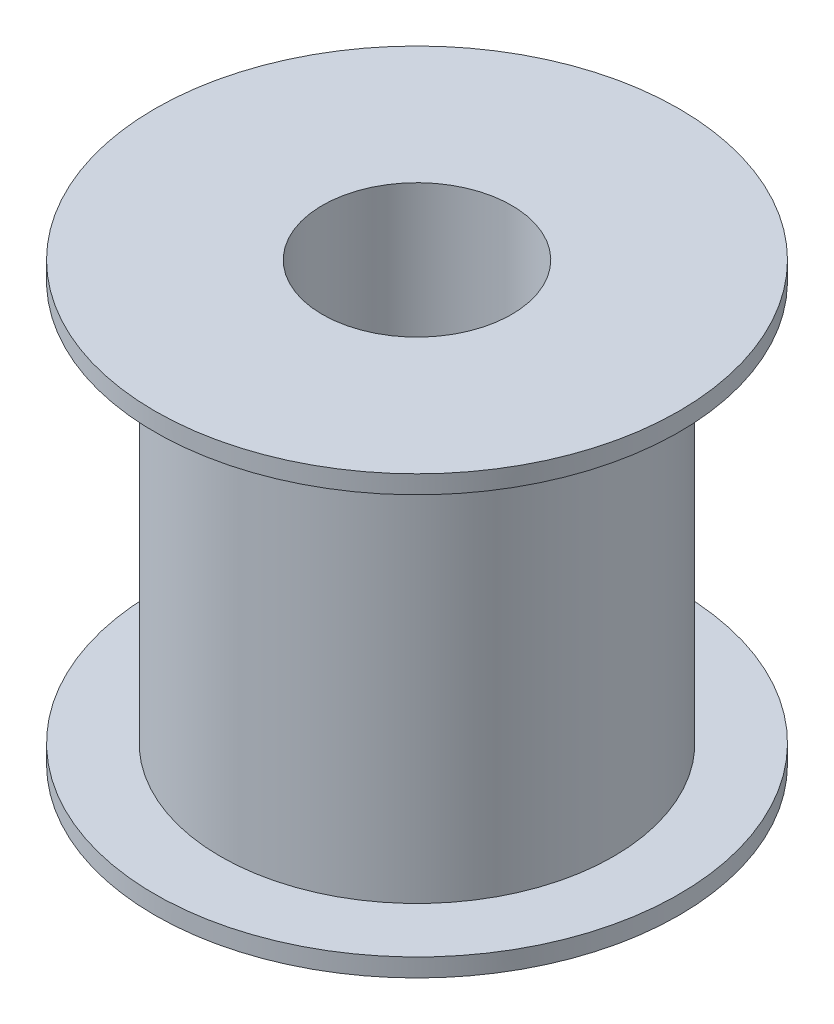
ISO-10303-21;
HEADER;
FILE_DESCRIPTION(('STEP AP214'),'2;1');
FILE_NAME('part.step','',(''),(''),'','','');
FILE_SCHEMA(('AUTOMOTIVE_DESIGN { 1 0 10303 214 1 1 1 1 }'));
ENDSEC;
DATA;
#1=APPLICATION_CONTEXT('core data for automotive mechanical design processes');
#2=APPLICATION_PROTOCOL_DEFINITION('international standard','automotive_design',2000,#1);
#3=PRODUCT_CONTEXT('',#1,'mechanical');
#4=PRODUCT('Part','Part','',(#3));
#5=PRODUCT_RELATED_PRODUCT_CATEGORY('part','',(#4));
#6=PRODUCT_DEFINITION_FORMATION('','',#4);
#7=PRODUCT_DEFINITION_CONTEXT('part definition',#1,'design');
#8=PRODUCT_DEFINITION('design','',#6,#7);
#9=PRODUCT_DEFINITION_SHAPE('','',#8);
#10=(LENGTH_UNIT() NAMED_UNIT(*) SI_UNIT(.MILLI.,.METRE.));
#11=(NAMED_UNIT(*) PLANE_ANGLE_UNIT() SI_UNIT($,.RADIAN.));
#12=(NAMED_UNIT(*) SI_UNIT($,.STERADIAN.) SOLID_ANGLE_UNIT());
#13=UNCERTAINTY_MEASURE_WITH_UNIT(LENGTH_MEASURE(1.E-05),#10,'distance_accuracy_value','');
#14=(GEOMETRIC_REPRESENTATION_CONTEXT(3) GLOBAL_UNCERTAINTY_ASSIGNED_CONTEXT((#13)) GLOBAL_UNIT_ASSIGNED_CONTEXT((#10,
#11,#12)) REPRESENTATION_CONTEXT('',''));
#15=CARTESIAN_POINT('',(0.,0.,0.));
#16=DIRECTION('',(0.,0.,1.));
#17=DIRECTION('',(1.,0.,0.));
#18=AXIS2_PLACEMENT_3D('',#15,#16,#17);
#19=CARTESIAN_POINT('',(0.,60.,0.));
#20=DIRECTION('',(0.,-1.,0.));
#21=DIRECTION('',(0.,0.,-1.));
#22=AXIS2_PLACEMENT_3D('',#19,#20,#21);
#23=CYLINDRICAL_SURFACE('',#22,36.);
#24=CARTESIAN_POINT('',(0.,0.,0.));
#25=DIRECTION('',(0.,1.,0.));
#26=DIRECTION('',(0.,0.,1.));
#27=AXIS2_PLACEMENT_3D('',#24,#25,#26);
#28=CIRCLE('',#27,36.);
#29=CARTESIAN_POINT('',(0.,0.,36.));
#30=VERTEX_POINT('',#29);
#31=EDGE_CURVE('E43',#30,#30,#28,.T.);
#32=ORIENTED_EDGE('',*,*,#31,.T.);
#33=EDGE_LOOP('',(#32));
#34=FACE_BOUND('',#33,.T.);
#35=CARTESIAN_POINT('',(0.,2.5,0.));
#36=DIRECTION('',(0.,-1.,0.));
#37=DIRECTION('',(0.,0.,-1.));
#38=AXIS2_PLACEMENT_3D('',#35,#36,#37);
#39=CIRCLE('',#38,36.);
#40=CARTESIAN_POINT('',(0.,2.5,-36.));
#41=VERTEX_POINT('',#40);
#42=EDGE_CURVE('E55',#41,#41,#39,.T.);
#43=ORIENTED_EDGE('',*,*,#42,.T.);
#44=EDGE_LOOP('',(#43));
#45=FACE_BOUND('',#44,.T.);
#46=ADVANCED_FACE('F40',(#34,#45),#23,.T.);
#47=CARTESIAN_POINT('',(0.,60.,0.));
#48=DIRECTION('',(0.,1.,0.));
#49=DIRECTION('',(0.,0.,1.));
#50=AXIS2_PLACEMENT_3D('',#47,#48,#49);
#51=CIRCLE('',#50,36.);
#52=CARTESIAN_POINT('',(0.,60.,36.));
#53=VERTEX_POINT('',#52);
#54=EDGE_CURVE('E10',#53,#53,#51,.T.);
#55=ORIENTED_EDGE('',*,*,#54,.F.);
#56=EDGE_LOOP('',(#55));
#57=FACE_BOUND('',#56,.T.);
#58=CARTESIAN_POINT('',(0.,57.5,0.));
#59=DIRECTION('',(0.,-1.,0.));
#60=DIRECTION('',(0.,0.,-1.));
#61=AXIS2_PLACEMENT_3D('',#58,#59,#60);
#62=CIRCLE('',#61,36.);
#63=CARTESIAN_POINT('',(0.,57.5,-36.));
#64=VERTEX_POINT('',#63);
#65=EDGE_CURVE('E66',#64,#64,#62,.T.);
#66=ORIENTED_EDGE('',*,*,#65,.F.);
#67=EDGE_LOOP('',(#66));
#68=FACE_BOUND('',#67,.T.);
#69=ADVANCED_FACE('F73',(#57,#68),#23,.T.);
#70=CARTESIAN_POINT('',(0.,60.,0.));
#71=DIRECTION('',(0.,1.,0.));
#72=DIRECTION('',(0.,0.,1.));
#73=AXIS2_PLACEMENT_3D('',#70,#71,#72);
#74=PLANE('',#73);
#75=ORIENTED_EDGE('',*,*,#54,.T.);
#76=EDGE_LOOP('',(#75));
#77=FACE_BOUND('',#76,.T.);
#78=CARTESIAN_POINT('',(0.,60.,0.));
#79=DIRECTION('',(0.,1.,0.));
#80=DIRECTION('',(0.,0.,1.));
#81=AXIS2_PLACEMENT_3D('',#78,#79,#80);
#82=CIRCLE('',#81,13.);
#83=CARTESIAN_POINT('',(0.,60.,13.));
#84=VERTEX_POINT('',#83);
#85=EDGE_CURVE('E50',#84,#84,#82,.T.);
#86=ORIENTED_EDGE('',*,*,#85,.F.);
#87=EDGE_LOOP('',(#86));
#88=FACE_BOUND('',#87,.T.);
#89=ADVANCED_FACE('F75',(#77,#88),#74,.T.);
#90=CARTESIAN_POINT('',(0.,0.,0.));
#91=DIRECTION('',(0.,1.,0.));
#92=DIRECTION('',(0.,0.,1.));
#93=AXIS2_PLACEMENT_3D('',#90,#91,#92);
#94=PLANE('',#93);
#95=ORIENTED_EDGE('',*,*,#31,.F.);
#96=EDGE_LOOP('',(#95));
#97=FACE_BOUND('',#96,.T.);
#98=CARTESIAN_POINT('',(0.,0.,0.));
#99=DIRECTION('',(0.,1.,0.));
#100=DIRECTION('',(0.,0.,1.));
#101=AXIS2_PLACEMENT_3D('',#98,#99,#100);
#102=CIRCLE('',#101,13.);
#103=CARTESIAN_POINT('',(0.,0.,13.));
#104=VERTEX_POINT('',#103);
#105=EDGE_CURVE('E52',#104,#104,#102,.T.);
#106=ORIENTED_EDGE('',*,*,#105,.T.);
#107=EDGE_LOOP('',(#106));
#108=FACE_BOUND('',#107,.T.);
#109=ADVANCED_FACE('F81',(#97,#108),#94,.F.);
#110=CARTESIAN_POINT('',(0.,60.,0.));
#111=DIRECTION('',(0.,-1.,0.));
#112=DIRECTION('',(0.,0.,-1.));
#113=AXIS2_PLACEMENT_3D('',#110,#111,#112);
#114=CYLINDRICAL_SURFACE('',#113,13.);
#115=ORIENTED_EDGE('',*,*,#85,.T.);
#116=EDGE_LOOP('',(#115));
#117=FACE_BOUND('',#116,.T.);
#118=ORIENTED_EDGE('',*,*,#105,.F.);
#119=EDGE_LOOP('',(#118));
#120=FACE_BOUND('',#119,.T.);
#121=ADVANCED_FACE('F93',(#117,#120),#114,.F.);
#122=CARTESIAN_POINT('',(-36.,2.5,0.));
#123=DIRECTION('',(0.,1.,0.));
#124=DIRECTION('',(0.,0.,1.));
#125=AXIS2_PLACEMENT_3D('',#122,#123,#124);
#126=PLANE('',#125);
#127=CARTESIAN_POINT('',(0.,2.5,0.));
#128=DIRECTION('',(0.,-1.,0.));
#129=DIRECTION('',(0.,0.,-1.));
#130=AXIS2_PLACEMENT_3D('',#127,#128,#129);
#131=CIRCLE('',#130,27.);
#132=CARTESIAN_POINT('',(0.,2.5,-27.));
#133=VERTEX_POINT('',#132);
#134=EDGE_CURVE('E60',#133,#133,#131,.T.);
#135=ORIENTED_EDGE('',*,*,#134,.T.);
#136=EDGE_LOOP('',(#135));
#137=FACE_BOUND('',#136,.T.);
#138=ORIENTED_EDGE('',*,*,#42,.F.);
#139=EDGE_LOOP('',(#138));
#140=FACE_BOUND('',#139,.T.);
#141=ADVANCED_FACE('F90',(#137,#140),#126,.T.);
#142=CARTESIAN_POINT('',(0.,0.,0.));
#143=DIRECTION('',(0.,-1.,0.));
#144=DIRECTION('',(0.,0.,-1.));
#145=AXIS2_PLACEMENT_3D('',#142,#143,#144);
#146=CYLINDRICAL_SURFACE('',#145,27.);
#147=CARTESIAN_POINT('',(0.,57.5,0.));
#148=DIRECTION('',(0.,-1.,0.));
#149=DIRECTION('',(0.,0.,-1.));
#150=AXIS2_PLACEMENT_3D('',#147,#148,#149);
#151=CIRCLE('',#150,27.);
#152=CARTESIAN_POINT('',(0.,57.5,-27.));
#153=VERTEX_POINT('',#152);
#154=EDGE_CURVE('E63',#153,#153,#151,.T.);
#155=ORIENTED_EDGE('',*,*,#154,.T.);
#156=EDGE_LOOP('',(#155));
#157=FACE_BOUND('',#156,.T.);
#158=ORIENTED_EDGE('',*,*,#134,.F.);
#159=EDGE_LOOP('',(#158));
#160=FACE_BOUND('',#159,.T.);
#161=ADVANCED_FACE('F92',(#157,#160),#146,.T.);
#162=CARTESIAN_POINT('',(-36.,57.5,0.));
#163=DIRECTION('',(0.,-1.,0.));
#164=DIRECTION('',(0.,0.,-1.));
#165=AXIS2_PLACEMENT_3D('',#162,#163,#164);
#166=PLANE('',#165);
#167=ORIENTED_EDGE('',*,*,#65,.T.);
#168=EDGE_LOOP('',(#167));
#169=FACE_BOUND('',#168,.T.);
#170=ORIENTED_EDGE('',*,*,#154,.F.);
#171=EDGE_LOOP('',(#170));
#172=FACE_BOUND('',#171,.T.);
#173=ADVANCED_FACE('F70',(#169,#172),#166,.T.);
#174=CLOSED_SHELL('',(#46,#69,#89,#109,#121,#141,#161,#173));
#175=MANIFOLD_SOLID_BREP('B2',#174);
#176=ADVANCED_BREP_SHAPE_REPRESENTATION('',(#18,#175),#14);
#177=SHAPE_DEFINITION_REPRESENTATION(#9,#176);
ENDSEC;
END-ISO-10303-21;
